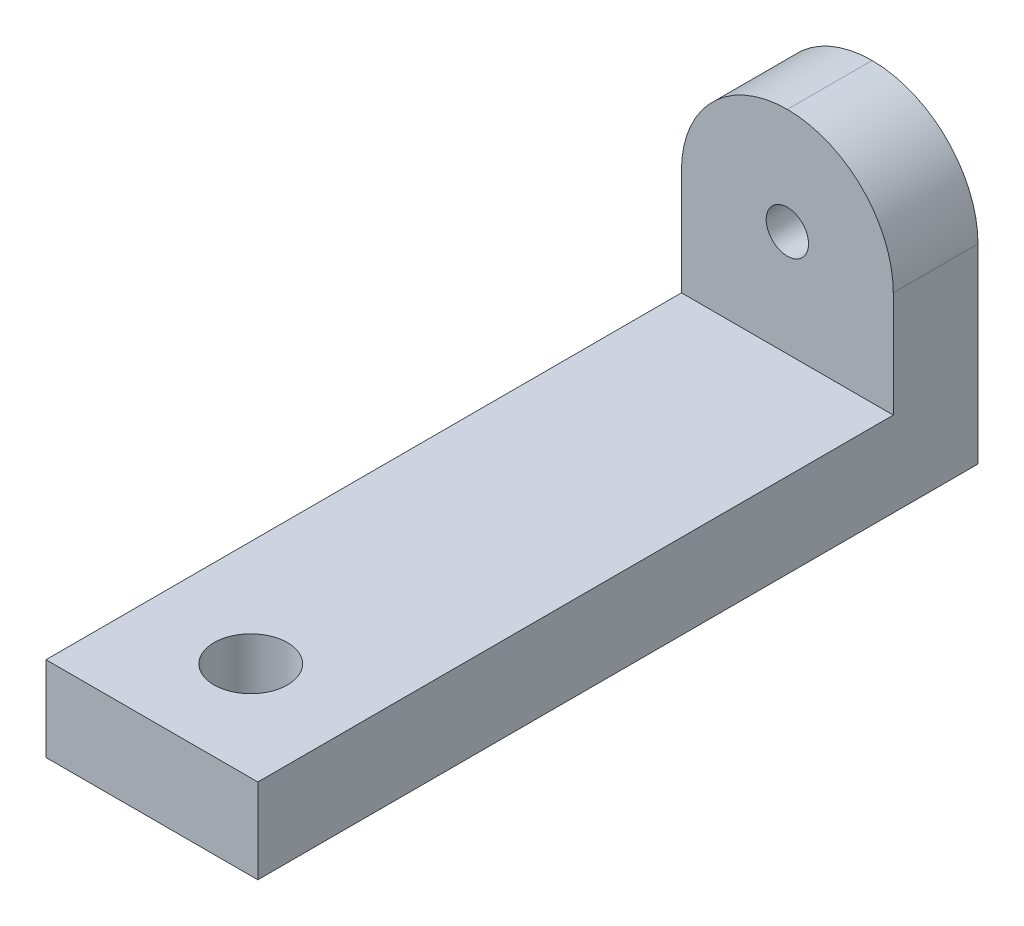
ISO-10303-21;
HEADER;
FILE_DESCRIPTION(('STEP AP214'),'2;1');
FILE_NAME('part.step','',(''),(''),'','','');
FILE_SCHEMA(('AUTOMOTIVE_DESIGN { 1 0 10303 214 1 1 1 1 }'));
ENDSEC;
DATA;
#1=APPLICATION_CONTEXT('core data for automotive mechanical design processes');
#2=APPLICATION_PROTOCOL_DEFINITION('international standard','automotive_design',2000,#1);
#3=PRODUCT_CONTEXT('',#1,'mechanical');
#4=PRODUCT('Part','Part','',(#3));
#5=PRODUCT_RELATED_PRODUCT_CATEGORY('part','',(#4));
#6=PRODUCT_DEFINITION_FORMATION('','',#4);
#7=PRODUCT_DEFINITION_CONTEXT('part definition',#1,'design');
#8=PRODUCT_DEFINITION('design','',#6,#7);
#9=PRODUCT_DEFINITION_SHAPE('','',#8);
#10=(LENGTH_UNIT() NAMED_UNIT(*) SI_UNIT(.MILLI.,.METRE.));
#11=(NAMED_UNIT(*) PLANE_ANGLE_UNIT() SI_UNIT($,.RADIAN.));
#12=(NAMED_UNIT(*) SI_UNIT($,.STERADIAN.) SOLID_ANGLE_UNIT());
#13=UNCERTAINTY_MEASURE_WITH_UNIT(LENGTH_MEASURE(1.E-05),#10,'distance_accuracy_value','');
#14=(GEOMETRIC_REPRESENTATION_CONTEXT(3) GLOBAL_UNCERTAINTY_ASSIGNED_CONTEXT((#13)) GLOBAL_UNIT_ASSIGNED_CONTEXT((#10,
#11,#12)) REPRESENTATION_CONTEXT('',''));
#15=CARTESIAN_POINT('',(0.,0.,0.));
#16=DIRECTION('',(0.,0.,1.));
#17=DIRECTION('',(1.,0.,0.));
#18=AXIS2_PLACEMENT_3D('',#15,#16,#17);
#19=CARTESIAN_POINT('',(15.,0.,0.));
#20=DIRECTION('',(0.,0.,-1.));
#21=DIRECTION('',(-1.,0.,0.));
#22=AXIS2_PLACEMENT_3D('',#19,#20,#21);
#23=PLANE('',#22);
#24=DIRECTION('',(0.,-1.,0.));
#25=VECTOR('',#24,1.);
#26=CARTESIAN_POINT('',(0.,0.,0.));
#27=LINE('',#26,#25);
#28=CARTESIAN_POINT('',(0.,6.,0.));
#29=VERTEX_POINT('',#28);
#30=CARTESIAN_POINT('',(0.,0.,0.));
#31=VERTEX_POINT('',#30);
#32=EDGE_CURVE('E115',#29,#31,#27,.T.);
#33=ORIENTED_EDGE('',*,*,#32,.T.);
#34=DIRECTION('',(-1.,0.,0.));
#35=VECTOR('',#34,1.);
#36=CARTESIAN_POINT('',(15.,0.,0.));
#37=LINE('',#36,#35);
#38=CARTESIAN_POINT('',(15.,0.,0.));
#39=VERTEX_POINT('',#38);
#40=EDGE_CURVE('E97',#39,#31,#37,.T.);
#41=ORIENTED_EDGE('',*,*,#40,.F.);
#42=DIRECTION('',(0.,-1.,0.));
#43=VECTOR('',#42,1.);
#44=CARTESIAN_POINT('',(15.,0.,0.));
#45=LINE('',#44,#43);
#46=CARTESIAN_POINT('',(15.,6.,0.));
#47=VERTEX_POINT('',#46);
#48=EDGE_CURVE('E103',#47,#39,#45,.T.);
#49=ORIENTED_EDGE('',*,*,#48,.F.);
#50=DIRECTION('',(-1.,0.,0.));
#51=VECTOR('',#50,1.);
#52=CARTESIAN_POINT('',(15.,6.,0.));
#53=LINE('',#52,#51);
#54=EDGE_CURVE('E146',#47,#29,#53,.T.);
#55=ORIENTED_EDGE('',*,*,#54,.T.);
#56=EDGE_LOOP('',(#33,#41,#49,#55));
#57=FACE_BOUND('',#56,.T.);
#58=ADVANCED_FACE('F35',(#57),#23,.F.);
#59=CARTESIAN_POINT('',(15.,0.,0.));
#60=DIRECTION('',(0.,1.,0.));
#61=DIRECTION('',(0.,0.,1.));
#62=AXIS2_PLACEMENT_3D('',#59,#60,#61);
#63=PLANE('',#62);
#64=CARTESIAN_POINT('',(7.5,0.,-7.));
#65=DIRECTION('',(0.,1.,0.));
#66=DIRECTION('',(0.,0.,1.));
#67=AXIS2_PLACEMENT_3D('',#64,#65,#66);
#68=CIRCLE('',#67,2.6);
#69=CARTESIAN_POINT('',(7.5,0.,-4.4));
#70=VERTEX_POINT('',#69);
#71=EDGE_CURVE('E153',#70,#70,#68,.T.);
#72=ORIENTED_EDGE('',*,*,#71,.T.);
#73=EDGE_LOOP('',(#72));
#74=FACE_BOUND('',#73,.T.);
#75=DIRECTION('',(0.,0.,-1.));
#76=VECTOR('',#75,1.);
#77=CARTESIAN_POINT('',(0.,0.,0.));
#78=LINE('',#77,#76);
#79=CARTESIAN_POINT('',(0.,0.,-51.));
#80=VERTEX_POINT('',#79);
#81=EDGE_CURVE('E139',#31,#80,#78,.T.);
#82=ORIENTED_EDGE('',*,*,#81,.T.);
#83=DIRECTION('',(-1.,0.,0.));
#84=VECTOR('',#83,1.);
#85=CARTESIAN_POINT('',(15.,0.,-51.));
#86=LINE('',#85,#84);
#87=CARTESIAN_POINT('',(15.,0.,-51.));
#88=VERTEX_POINT('',#87);
#89=EDGE_CURVE('E100',#88,#80,#86,.T.);
#90=ORIENTED_EDGE('',*,*,#89,.F.);
#91=DIRECTION('',(0.,0.,-1.));
#92=VECTOR('',#91,1.);
#93=CARTESIAN_POINT('',(15.,0.,0.));
#94=LINE('',#93,#92);
#95=EDGE_CURVE('E92',#39,#88,#94,.T.);
#96=ORIENTED_EDGE('',*,*,#95,.F.);
#97=ORIENTED_EDGE('',*,*,#40,.T.);
#98=EDGE_LOOP('',(#82,#90,#96,#97));
#99=FACE_BOUND('',#98,.T.);
#100=ADVANCED_FACE('F95',(#74,#99),#63,.F.);
#101=CARTESIAN_POINT('',(15.,3.91666666666667,-51.));
#102=DIRECTION('',(0.,0.,1.));
#103=DIRECTION('',(1.,0.,0.));
#104=AXIS2_PLACEMENT_3D('',#101,#102,#103);
#105=PLANE('',#104);
#106=CARTESIAN_POINT('',(7.5,13.5,-51.));
#107=DIRECTION('',(0.,0.,1.));
#108=DIRECTION('',(1.,0.,0.));
#109=AXIS2_PLACEMENT_3D('',#106,#107,#108);
#110=CIRCLE('',#109,1.5);
#111=CARTESIAN_POINT('',(9.,13.5,-51.));
#112=VERTEX_POINT('',#111);
#113=EDGE_CURVE('E163',#112,#112,#110,.T.);
#114=ORIENTED_EDGE('',*,*,#113,.T.);
#115=EDGE_LOOP('',(#114));
#116=FACE_BOUND('',#115,.T.);
#117=DIRECTION('',(0.,1.,0.));
#118=VECTOR('',#117,1.);
#119=CARTESIAN_POINT('',(0.,3.91666666666667,-51.));
#120=LINE('',#119,#118);
#121=CARTESIAN_POINT('',(0.,13.5,-51.));
#122=VERTEX_POINT('',#121);
#123=EDGE_CURVE('E133',#80,#122,#120,.T.);
#124=ORIENTED_EDGE('',*,*,#123,.T.);
#125=CARTESIAN_POINT('',(7.5,13.5,-51.));
#126=DIRECTION('',(0.,0.,1.));
#127=DIRECTION('',(1.,0.,0.));
#128=AXIS2_PLACEMENT_3D('',#125,#126,#127);
#129=CIRCLE('',#128,7.5);
#130=CARTESIAN_POINT('',(7.5,21.,-51.));
#131=VERTEX_POINT('',#130);
#132=EDGE_CURVE('E44',#122,#131,#129,.F.);
#133=ORIENTED_EDGE('',*,*,#132,.T.);
#134=CARTESIAN_POINT('',(7.5,13.5,-51.));
#135=DIRECTION('',(0.,0.,1.));
#136=DIRECTION('',(1.,0.,0.));
#137=AXIS2_PLACEMENT_3D('',#134,#135,#136);
#138=CIRCLE('',#137,7.5);
#139=CARTESIAN_POINT('',(15.,13.5,-51.));
#140=VERTEX_POINT('',#139);
#141=EDGE_CURVE('E51',#131,#140,#138,.F.);
#142=ORIENTED_EDGE('',*,*,#141,.T.);
#143=DIRECTION('',(0.,1.,0.));
#144=VECTOR('',#143,1.);
#145=CARTESIAN_POINT('',(15.,0.,-51.));
#146=LINE('',#145,#144);
#147=EDGE_CURVE('E102',#88,#140,#146,.T.);
#148=ORIENTED_EDGE('',*,*,#147,.F.);
#149=ORIENTED_EDGE('',*,*,#89,.T.);
#150=EDGE_LOOP('',(#124,#133,#142,#148,#149));
#151=FACE_BOUND('',#150,.T.);
#152=ADVANCED_FACE('F138',(#116,#151),#105,.F.);
#153=CARTESIAN_POINT('',(15.,6.,-45.));
#154=DIRECTION('',(0.,0.,-1.));
#155=DIRECTION('',(-1.,0.,0.));
#156=AXIS2_PLACEMENT_3D('',#153,#154,#155);
#157=PLANE('',#156);
#158=CARTESIAN_POINT('',(7.5,13.5,-45.));
#159=DIRECTION('',(0.,0.,1.));
#160=DIRECTION('',(1.,0.,0.));
#161=AXIS2_PLACEMENT_3D('',#158,#159,#160);
#162=CIRCLE('',#161,1.5);
#163=CARTESIAN_POINT('',(9.,13.5,-45.));
#164=VERTEX_POINT('',#163);
#165=EDGE_CURVE('E165',#164,#164,#162,.T.);
#166=ORIENTED_EDGE('',*,*,#165,.F.);
#167=EDGE_LOOP('',(#166));
#168=FACE_BOUND('',#167,.T.);
#169=CARTESIAN_POINT('',(7.5,13.5,-45.));
#170=DIRECTION('',(0.,0.,-1.));
#171=DIRECTION('',(-1.,0.,0.));
#172=AXIS2_PLACEMENT_3D('',#169,#170,#171);
#173=CIRCLE('',#172,7.5);
#174=CARTESIAN_POINT('',(15.,13.5,-45.));
#175=VERTEX_POINT('',#174);
#176=CARTESIAN_POINT('',(7.5,21.,-45.));
#177=VERTEX_POINT('',#176);
#178=EDGE_CURVE('E116',#175,#177,#173,.F.);
#179=ORIENTED_EDGE('',*,*,#178,.T.);
#180=CARTESIAN_POINT('',(7.5,13.5,-45.));
#181=DIRECTION('',(0.,0.,-1.));
#182=DIRECTION('',(-1.,0.,0.));
#183=AXIS2_PLACEMENT_3D('',#180,#181,#182);
#184=CIRCLE('',#183,7.5);
#185=CARTESIAN_POINT('',(0.,13.5,-45.));
#186=VERTEX_POINT('',#185);
#187=EDGE_CURVE('E118',#177,#186,#184,.F.);
#188=ORIENTED_EDGE('',*,*,#187,.T.);
#189=DIRECTION('',(0.,-1.,0.));
#190=VECTOR('',#189,1.);
#191=CARTESIAN_POINT('',(0.,6.,-45.));
#192=LINE('',#191,#190);
#193=CARTESIAN_POINT('',(0.,6.,-45.));
#194=VERTEX_POINT('',#193);
#195=EDGE_CURVE('E135',#186,#194,#192,.T.);
#196=ORIENTED_EDGE('',*,*,#195,.T.);
#197=DIRECTION('',(-1.,0.,0.));
#198=VECTOR('',#197,1.);
#199=CARTESIAN_POINT('',(15.,6.,-45.));
#200=LINE('',#199,#198);
#201=CARTESIAN_POINT('',(15.,6.,-45.));
#202=VERTEX_POINT('',#201);
#203=EDGE_CURVE('E120',#202,#194,#200,.T.);
#204=ORIENTED_EDGE('',*,*,#203,.F.);
#205=DIRECTION('',(0.,-1.,0.));
#206=VECTOR('',#205,1.);
#207=CARTESIAN_POINT('',(15.,6.,-45.));
#208=LINE('',#207,#206);
#209=EDGE_CURVE('E159',#175,#202,#208,.T.);
#210=ORIENTED_EDGE('',*,*,#209,.F.);
#211=EDGE_LOOP('',(#179,#188,#196,#204,#210));
#212=FACE_BOUND('',#211,.T.);
#213=ADVANCED_FACE('F179',(#168,#212),#157,.F.);
#214=CARTESIAN_POINT('',(15.,6.,0.));
#215=DIRECTION('',(0.,-1.,0.));
#216=DIRECTION('',(0.,0.,-1.));
#217=AXIS2_PLACEMENT_3D('',#214,#215,#216);
#218=PLANE('',#217);
#219=CARTESIAN_POINT('',(7.5,6.,-7.));
#220=DIRECTION('',(0.,1.,0.));
#221=DIRECTION('',(0.,0.,1.));
#222=AXIS2_PLACEMENT_3D('',#219,#220,#221);
#223=CIRCLE('',#222,2.6);
#224=CARTESIAN_POINT('',(7.5,6.,-4.4));
#225=VERTEX_POINT('',#224);
#226=EDGE_CURVE('E155',#225,#225,#223,.T.);
#227=ORIENTED_EDGE('',*,*,#226,.F.);
#228=EDGE_LOOP('',(#227));
#229=FACE_BOUND('',#228,.T.);
#230=DIRECTION('',(0.,0.,1.));
#231=VECTOR('',#230,1.);
#232=CARTESIAN_POINT('',(0.,6.,0.));
#233=LINE('',#232,#231);
#234=EDGE_CURVE('E112',#194,#29,#233,.T.);
#235=ORIENTED_EDGE('',*,*,#234,.T.);
#236=ORIENTED_EDGE('',*,*,#54,.F.);
#237=DIRECTION('',(0.,0.,1.));
#238=VECTOR('',#237,1.);
#239=CARTESIAN_POINT('',(15.,6.,0.));
#240=LINE('',#239,#238);
#241=EDGE_CURVE('E108',#202,#47,#240,.T.);
#242=ORIENTED_EDGE('',*,*,#241,.F.);
#243=ORIENTED_EDGE('',*,*,#203,.T.);
#244=EDGE_LOOP('',(#235,#236,#242,#243));
#245=FACE_BOUND('',#244,.T.);
#246=ADVANCED_FACE('F150',(#229,#245),#218,.F.);
#247=CARTESIAN_POINT('',(15.,0.,0.));
#248=DIRECTION('',(-1.,0.,0.));
#249=DIRECTION('',(0.,0.,1.));
#250=AXIS2_PLACEMENT_3D('',#247,#248,#249);
#251=PLANE('',#250);
#252=ORIENTED_EDGE('',*,*,#147,.T.);
#253=DIRECTION('',(0.,0.,1.));
#254=VECTOR('',#253,1.);
#255=CARTESIAN_POINT('',(15.,13.5,0.));
#256=LINE('',#255,#254);
#257=EDGE_CURVE('E11',#140,#175,#256,.T.);
#258=ORIENTED_EDGE('',*,*,#257,.T.);
#259=ORIENTED_EDGE('',*,*,#209,.T.);
#260=ORIENTED_EDGE('',*,*,#241,.T.);
#261=ORIENTED_EDGE('',*,*,#48,.T.);
#262=ORIENTED_EDGE('',*,*,#95,.T.);
#263=EDGE_LOOP('',(#252,#258,#259,#260,#261,#262));
#264=FACE_BOUND('',#263,.T.);
#265=ADVANCED_FACE('F106',(#264),#251,.F.);
#266=CARTESIAN_POINT('',(0.,0.,0.));
#267=DIRECTION('',(-1.,0.,0.));
#268=DIRECTION('',(0.,0.,1.));
#269=AXIS2_PLACEMENT_3D('',#266,#267,#268);
#270=PLANE('',#269);
#271=ORIENTED_EDGE('',*,*,#195,.F.);
#272=DIRECTION('',(0.,0.,1.));
#273=VECTOR('',#272,1.);
#274=CARTESIAN_POINT('',(0.,13.5,-51.));
#275=LINE('',#274,#273);
#276=EDGE_CURVE('E125',#186,#122,#275,.F.);
#277=ORIENTED_EDGE('',*,*,#276,.T.);
#278=ORIENTED_EDGE('',*,*,#123,.F.);
#279=ORIENTED_EDGE('',*,*,#81,.F.);
#280=ORIENTED_EDGE('',*,*,#32,.F.);
#281=ORIENTED_EDGE('',*,*,#234,.F.);
#282=EDGE_LOOP('',(#271,#277,#278,#279,#280,#281));
#283=FACE_BOUND('',#282,.T.);
#284=ADVANCED_FACE('F132',(#283),#270,.T.);
#285=CARTESIAN_POINT('',(7.5,0.,-7.));
#286=DIRECTION('',(0.,1.,0.));
#287=DIRECTION('',(0.,0.,1.));
#288=AXIS2_PLACEMENT_3D('',#285,#286,#287);
#289=CYLINDRICAL_SURFACE('',#288,2.6);
#290=ORIENTED_EDGE('',*,*,#71,.F.);
#291=EDGE_LOOP('',(#290));
#292=FACE_BOUND('',#291,.T.);
#293=ORIENTED_EDGE('',*,*,#226,.T.);
#294=EDGE_LOOP('',(#293));
#295=FACE_BOUND('',#294,.T.);
#296=ADVANCED_FACE('F175',(#292,#295),#289,.F.);
#297=CARTESIAN_POINT('',(7.5,13.5,-51.));
#298=DIRECTION('',(0.,0.,1.));
#299=DIRECTION('',(1.,0.,0.));
#300=AXIS2_PLACEMENT_3D('',#297,#298,#299);
#301=CYLINDRICAL_SURFACE('',#300,1.5);
#302=ORIENTED_EDGE('',*,*,#113,.F.);
#303=EDGE_LOOP('',(#302));
#304=FACE_BOUND('',#303,.T.);
#305=ORIENTED_EDGE('',*,*,#165,.T.);
#306=EDGE_LOOP('',(#305));
#307=FACE_BOUND('',#306,.T.);
#308=ADVANCED_FACE('F172',(#304,#307),#301,.F.);
#309=CARTESIAN_POINT('',(7.5,13.5,0.));
#310=DIRECTION('',(0.,0.,1.));
#311=DIRECTION('',(1.,0.,0.));
#312=AXIS2_PLACEMENT_3D('',#309,#310,#311);
#313=CYLINDRICAL_SURFACE('',#312,7.5);
#314=ORIENTED_EDGE('',*,*,#257,.F.);
#315=ORIENTED_EDGE('',*,*,#141,.F.);
#316=DIRECTION('',(0.,0.,1.));
#317=VECTOR('',#316,1.);
#318=CARTESIAN_POINT('',(7.5,21.,-51.));
#319=LINE('',#318,#317);
#320=EDGE_CURVE('E39',#177,#131,#319,.F.);
#321=ORIENTED_EDGE('',*,*,#320,.F.);
#322=ORIENTED_EDGE('',*,*,#178,.F.);
#323=EDGE_LOOP('',(#314,#315,#321,#322));
#324=FACE_BOUND('',#323,.T.);
#325=ADVANCED_FACE('F37',(#324),#313,.T.);
#326=CARTESIAN_POINT('',(7.5,13.5,-51.));
#327=DIRECTION('',(0.,0.,-1.));
#328=DIRECTION('',(-1.,0.,0.));
#329=AXIS2_PLACEMENT_3D('',#326,#327,#328);
#330=CYLINDRICAL_SURFACE('',#329,7.5);
#331=ORIENTED_EDGE('',*,*,#132,.F.);
#332=ORIENTED_EDGE('',*,*,#276,.F.);
#333=ORIENTED_EDGE('',*,*,#187,.F.);
#334=ORIENTED_EDGE('',*,*,#320,.T.);
#335=EDGE_LOOP('',(#331,#332,#333,#334));
#336=FACE_BOUND('',#335,.T.);
#337=ADVANCED_FACE('F187',(#336),#330,.T.);
#338=CLOSED_SHELL('',(#58,#100,#152,#213,#246,#265,#284,#296,#308,#325,#337));
#339=MANIFOLD_SOLID_BREP('B2',#338);
#340=ADVANCED_BREP_SHAPE_REPRESENTATION('',(#18,#339),#14);
#341=SHAPE_DEFINITION_REPRESENTATION(#9,#340);
ENDSEC;
END-ISO-10303-21;
